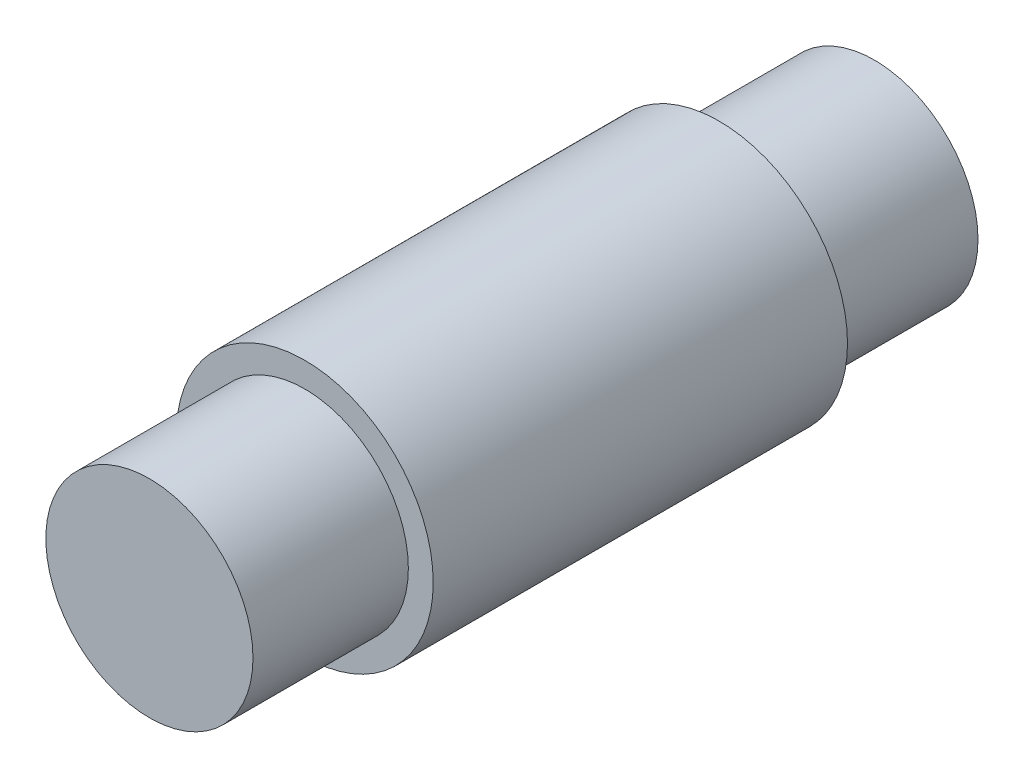
ISO-10303-21;
HEADER;
FILE_DESCRIPTION(('STEP AP214'),'2;1');
FILE_NAME('part.step','',(''),(''),'','','');
FILE_SCHEMA(('AUTOMOTIVE_DESIGN { 1 0 10303 214 1 1 1 1 }'));
ENDSEC;
DATA;
#1=APPLICATION_CONTEXT('core data for automotive mechanical design processes');
#2=APPLICATION_PROTOCOL_DEFINITION('international standard','automotive_design',2000,#1);
#3=PRODUCT_CONTEXT('',#1,'mechanical');
#4=PRODUCT('Part','Part','',(#3));
#5=PRODUCT_RELATED_PRODUCT_CATEGORY('part','',(#4));
#6=PRODUCT_DEFINITION_FORMATION('','',#4);
#7=PRODUCT_DEFINITION_CONTEXT('part definition',#1,'design');
#8=PRODUCT_DEFINITION('design','',#6,#7);
#9=PRODUCT_DEFINITION_SHAPE('','',#8);
#10=(LENGTH_UNIT() NAMED_UNIT(*) SI_UNIT(.MILLI.,.METRE.));
#11=(NAMED_UNIT(*) PLANE_ANGLE_UNIT() SI_UNIT($,.RADIAN.));
#12=(NAMED_UNIT(*) SI_UNIT($,.STERADIAN.) SOLID_ANGLE_UNIT());
#13=UNCERTAINTY_MEASURE_WITH_UNIT(LENGTH_MEASURE(1.E-05),#10,'distance_accuracy_value','');
#14=(GEOMETRIC_REPRESENTATION_CONTEXT(3) GLOBAL_UNCERTAINTY_ASSIGNED_CONTEXT((#13)) GLOBAL_UNIT_ASSIGNED_CONTEXT((#10,
#11,#12)) REPRESENTATION_CONTEXT('',''));
#15=CARTESIAN_POINT('',(0.,0.,0.));
#16=DIRECTION('',(0.,0.,1.));
#17=DIRECTION('',(1.,0.,0.));
#18=AXIS2_PLACEMENT_3D('',#15,#16,#17);
#19=CARTESIAN_POINT('',(0.,0.,2.5));
#20=DIRECTION('',(0.,0.,-1.));
#21=DIRECTION('',(-1.,0.,0.));
#22=AXIS2_PLACEMENT_3D('',#19,#20,#21);
#23=CYLINDRICAL_SURFACE('',#22,1.55);
#24=CARTESIAN_POINT('',(0.,0.,2.5));
#25=DIRECTION('',(0.,0.,1.));
#26=DIRECTION('',(1.,0.,0.));
#27=AXIS2_PLACEMENT_3D('',#24,#25,#26);
#28=CIRCLE('',#27,1.55);
#29=CARTESIAN_POINT('',(1.55,0.,2.5));
#30=VERTEX_POINT('',#29);
#31=EDGE_CURVE('E45',#30,#30,#28,.T.);
#32=ORIENTED_EDGE('',*,*,#31,.F.);
#33=EDGE_LOOP('',(#32));
#34=FACE_BOUND('',#33,.T.);
#35=CARTESIAN_POINT('',(0.,0.,-2.5));
#36=DIRECTION('',(0.,0.,1.));
#37=DIRECTION('',(1.,0.,0.));
#38=AXIS2_PLACEMENT_3D('',#35,#36,#37);
#39=CIRCLE('',#38,1.55);
#40=CARTESIAN_POINT('',(1.55,0.,-2.5));
#41=VERTEX_POINT('',#40);
#42=EDGE_CURVE('E40',#41,#41,#39,.T.);
#43=ORIENTED_EDGE('',*,*,#42,.T.);
#44=EDGE_LOOP('',(#43));
#45=FACE_BOUND('',#44,.T.);
#46=ADVANCED_FACE('F37',(#34,#45),#23,.T.);
#47=CARTESIAN_POINT('',(0.,0.,2.5));
#48=DIRECTION('',(0.,0.,1.));
#49=DIRECTION('',(1.,0.,0.));
#50=AXIS2_PLACEMENT_3D('',#47,#48,#49);
#51=PLANE('',#50);
#52=CARTESIAN_POINT('',(0.,0.,2.5));
#53=DIRECTION('',(0.,0.,1.));
#54=DIRECTION('',(1.,0.,0.));
#55=AXIS2_PLACEMENT_3D('',#52,#53,#54);
#56=CIRCLE('',#55,1.25);
#57=CARTESIAN_POINT('',(1.25,0.,2.5));
#58=VERTEX_POINT('',#57);
#59=EDGE_CURVE('E10',#58,#58,#56,.T.);
#60=ORIENTED_EDGE('',*,*,#59,.F.);
#61=EDGE_LOOP('',(#60));
#62=FACE_BOUND('',#61,.T.);
#63=ORIENTED_EDGE('',*,*,#31,.T.);
#64=EDGE_LOOP('',(#63));
#65=FACE_BOUND('',#64,.T.);
#66=ADVANCED_FACE('F84',(#62,#65),#51,.T.);
#67=CARTESIAN_POINT('',(0.,0.,-2.5));
#68=DIRECTION('',(0.,0.,1.));
#69=DIRECTION('',(1.,0.,0.));
#70=AXIS2_PLACEMENT_3D('',#67,#68,#69);
#71=PLANE('',#70);
#72=CARTESIAN_POINT('',(0.,0.,-2.5));
#73=DIRECTION('',(0.,0.,1.));
#74=DIRECTION('',(1.,0.,0.));
#75=AXIS2_PLACEMENT_3D('',#72,#73,#74);
#76=CIRCLE('',#75,1.25);
#77=CARTESIAN_POINT('',(1.25,0.,-2.5));
#78=VERTEX_POINT('',#77);
#79=EDGE_CURVE('E60',#78,#78,#76,.T.);
#80=ORIENTED_EDGE('',*,*,#79,.T.);
#81=EDGE_LOOP('',(#80));
#82=FACE_BOUND('',#81,.T.);
#83=ORIENTED_EDGE('',*,*,#42,.F.);
#84=EDGE_LOOP('',(#83));
#85=FACE_BOUND('',#84,.T.);
#86=ADVANCED_FACE('F65',(#82,#85),#71,.F.);
#87=CARTESIAN_POINT('',(0.,0.,4.375));
#88=DIRECTION('',(0.,0.,-1.));
#89=DIRECTION('',(-1.,0.,0.));
#90=AXIS2_PLACEMENT_3D('',#87,#88,#89);
#91=CYLINDRICAL_SURFACE('',#90,1.25);
#92=CARTESIAN_POINT('',(0.,0.,4.375));
#93=DIRECTION('',(0.,0.,1.));
#94=DIRECTION('',(1.,0.,0.));
#95=AXIS2_PLACEMENT_3D('',#92,#93,#94);
#96=CIRCLE('',#95,1.25);
#97=CARTESIAN_POINT('',(1.25,0.,4.375));
#98=VERTEX_POINT('',#97);
#99=EDGE_CURVE('E52',#98,#98,#96,.T.);
#100=ORIENTED_EDGE('',*,*,#99,.F.);
#101=EDGE_LOOP('',(#100));
#102=FACE_BOUND('',#101,.T.);
#103=ORIENTED_EDGE('',*,*,#59,.T.);
#104=EDGE_LOOP('',(#103));
#105=FACE_BOUND('',#104,.T.);
#106=ADVANCED_FACE('F80',(#102,#105),#91,.T.);
#107=CARTESIAN_POINT('',(0.,0.,4.375));
#108=DIRECTION('',(0.,0.,1.));
#109=DIRECTION('',(1.,0.,0.));
#110=AXIS2_PLACEMENT_3D('',#107,#108,#109);
#111=PLANE('',#110);
#112=ORIENTED_EDGE('',*,*,#99,.T.);
#113=EDGE_LOOP('',(#112));
#114=FACE_BOUND('',#113,.T.);
#115=ADVANCED_FACE('F71',(#114),#111,.T.);
#116=CARTESIAN_POINT('',(0.,0.,-4.375));
#117=DIRECTION('',(0.,0.,1.));
#118=DIRECTION('',(-1.,0.,0.));
#119=AXIS2_PLACEMENT_3D('',#116,#117,#118);
#120=CYLINDRICAL_SURFACE('',#119,1.25);
#121=CARTESIAN_POINT('',(0.,0.,-4.375));
#122=DIRECTION('',(0.,0.,1.));
#123=DIRECTION('',(1.,0.,0.));
#124=AXIS2_PLACEMENT_3D('',#121,#122,#123);
#125=CIRCLE('',#124,1.25);
#126=CARTESIAN_POINT('',(1.25,0.,-4.375));
#127=VERTEX_POINT('',#126);
#128=EDGE_CURVE('E56',#127,#127,#125,.T.);
#129=ORIENTED_EDGE('',*,*,#128,.T.);
#130=EDGE_LOOP('',(#129));
#131=FACE_BOUND('',#130,.T.);
#132=ORIENTED_EDGE('',*,*,#79,.F.);
#133=EDGE_LOOP('',(#132));
#134=FACE_BOUND('',#133,.T.);
#135=ADVANCED_FACE('F68',(#131,#134),#120,.T.);
#136=CARTESIAN_POINT('',(0.,0.,-4.375));
#137=DIRECTION('',(0.,0.,-1.));
#138=DIRECTION('',(1.,0.,0.));
#139=AXIS2_PLACEMENT_3D('',#136,#137,#138);
#140=PLANE('',#139);
#141=ORIENTED_EDGE('',*,*,#128,.F.);
#142=EDGE_LOOP('',(#141));
#143=FACE_BOUND('',#142,.T.);
#144=ADVANCED_FACE('F70',(#143),#140,.T.);
#145=CLOSED_SHELL('',(#46,#66,#86,#106,#115,#135,#144));
#146=MANIFOLD_SOLID_BREP('B2',#145);
#147=ADVANCED_BREP_SHAPE_REPRESENTATION('',(#18,#146),#14);
#148=SHAPE_DEFINITION_REPRESENTATION(#9,#147);
ENDSEC;
END-ISO-10303-21;
